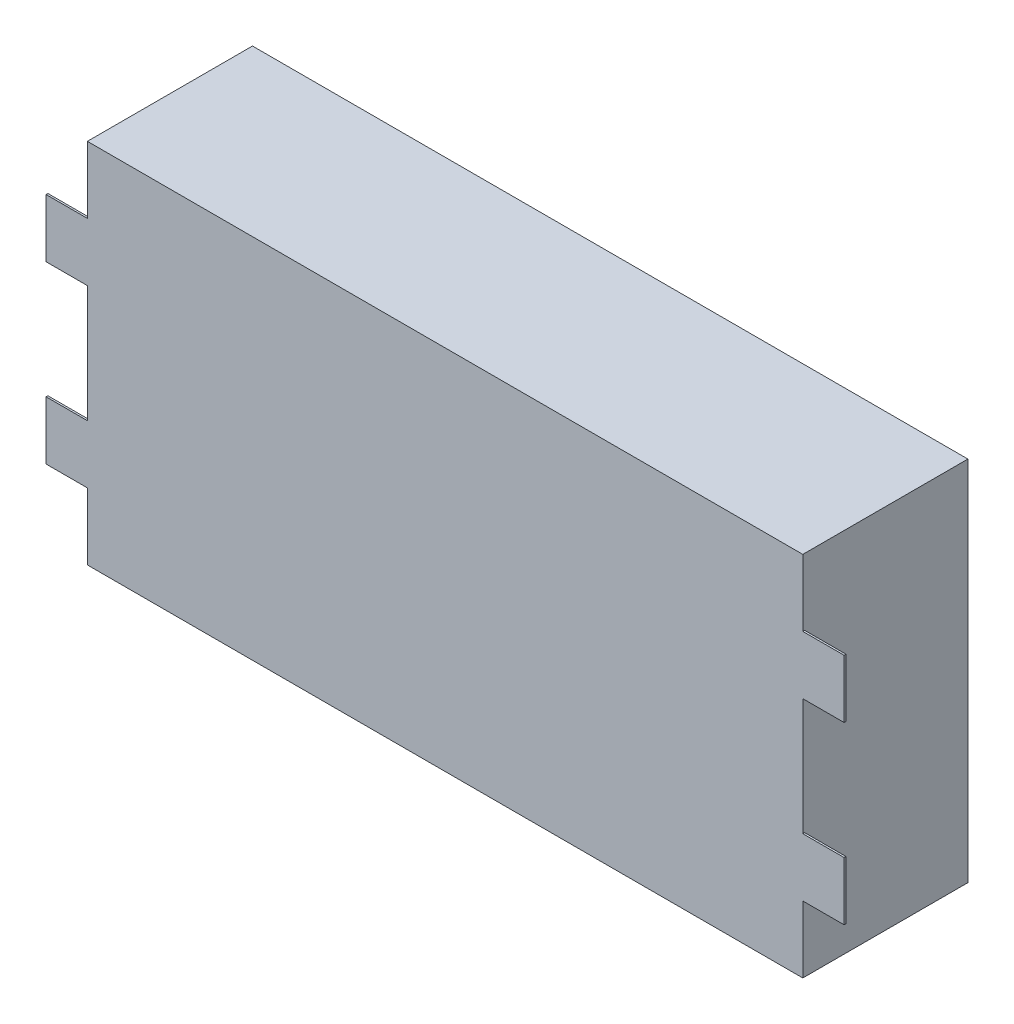
ISO-10303-21;
HEADER;
FILE_DESCRIPTION(('STEP AP214'),'2;1');
FILE_NAME('part.step','',(''),(''),'','','');
FILE_SCHEMA(('AUTOMOTIVE_DESIGN { 1 0 10303 214 1 1 1 1 }'));
ENDSEC;
DATA;
#1=APPLICATION_CONTEXT('core data for automotive mechanical design processes');
#2=APPLICATION_PROTOCOL_DEFINITION('international standard','automotive_design',2000,#1);
#3=PRODUCT_CONTEXT('',#1,'mechanical');
#4=PRODUCT('Part','Part','',(#3));
#5=PRODUCT_RELATED_PRODUCT_CATEGORY('part','',(#4));
#6=PRODUCT_DEFINITION_FORMATION('','',#4);
#7=PRODUCT_DEFINITION_CONTEXT('part definition',#1,'design');
#8=PRODUCT_DEFINITION('design','',#6,#7);
#9=PRODUCT_DEFINITION_SHAPE('','',#8);
#10=(LENGTH_UNIT() NAMED_UNIT(*) SI_UNIT(.MILLI.,.METRE.));
#11=(NAMED_UNIT(*) PLANE_ANGLE_UNIT() SI_UNIT($,.RADIAN.));
#12=(NAMED_UNIT(*) SI_UNIT($,.STERADIAN.) SOLID_ANGLE_UNIT());
#13=UNCERTAINTY_MEASURE_WITH_UNIT(LENGTH_MEASURE(1.E-05),#10,'distance_accuracy_value','');
#14=(GEOMETRIC_REPRESENTATION_CONTEXT(3) GLOBAL_UNCERTAINTY_ASSIGNED_CONTEXT((#13)) GLOBAL_UNIT_ASSIGNED_CONTEXT((#10,
#11,#12)) REPRESENTATION_CONTEXT('',''));
#15=CARTESIAN_POINT('',(0.,0.,0.));
#16=DIRECTION('',(0.,0.,1.));
#17=DIRECTION('',(1.,0.,0.));
#18=AXIS2_PLACEMENT_3D('',#15,#16,#17);
#19=CARTESIAN_POINT('',(39.,20.,18.));
#20=DIRECTION('',(-1.,0.,0.));
#21=DIRECTION('',(0.,-1.,0.));
#22=AXIS2_PLACEMENT_3D('',#19,#20,#21);
#23=PLANE('',#22);
#24=DIRECTION('',(0.,1.,0.));
#25=VECTOR('',#24,1.);
#26=CARTESIAN_POINT('',(39.,0.,17.8));
#27=LINE('',#26,#25);
#28=CARTESIAN_POINT('',(39.,-12.725,17.8));
#29=VERTEX_POINT('',#28);
#30=CARTESIAN_POINT('',(39.,-6.375,17.8));
#31=VERTEX_POINT('',#30);
#32=EDGE_CURVE('E183',#29,#31,#27,.T.);
#33=ORIENTED_EDGE('',*,*,#32,.F.);
#34=DIRECTION('',(0.,0.,1.));
#35=VECTOR('',#34,1.);
#36=CARTESIAN_POINT('',(39.,-12.725,17.8));
#37=LINE('',#36,#35);
#38=CARTESIAN_POINT('',(39.,-12.725,18.));
#39=VERTEX_POINT('',#38);
#40=EDGE_CURVE('E196',#29,#39,#37,.T.);
#41=ORIENTED_EDGE('',*,*,#40,.T.);
#42=DIRECTION('',(0.,1.,0.));
#43=VECTOR('',#42,1.);
#44=CARTESIAN_POINT('',(39.,20.,18.));
#45=LINE('',#44,#43);
#46=CARTESIAN_POINT('',(39.,-20.,18.));
#47=VERTEX_POINT('',#46);
#48=EDGE_CURVE('E296',#47,#39,#45,.T.);
#49=ORIENTED_EDGE('',*,*,#48,.F.);
#50=DIRECTION('',(0.,0.,-1.));
#51=VECTOR('',#50,1.);
#52=CARTESIAN_POINT('',(39.,-20.,18.));
#53=LINE('',#52,#51);
#54=CARTESIAN_POINT('',(39.,-20.,0.));
#55=VERTEX_POINT('',#54);
#56=EDGE_CURVE('E309',#47,#55,#53,.T.);
#57=ORIENTED_EDGE('',*,*,#56,.T.);
#58=DIRECTION('',(0.,1.,0.));
#59=VECTOR('',#58,1.);
#60=CARTESIAN_POINT('',(39.,20.,0.));
#61=LINE('',#60,#59);
#62=CARTESIAN_POINT('',(39.,20.,0.));
#63=VERTEX_POINT('',#62);
#64=EDGE_CURVE('E290',#55,#63,#61,.T.);
#65=ORIENTED_EDGE('',*,*,#64,.T.);
#66=DIRECTION('',(0.,0.,-1.));
#67=VECTOR('',#66,1.);
#68=CARTESIAN_POINT('',(39.,20.,18.));
#69=LINE('',#68,#67);
#70=CARTESIAN_POINT('',(39.,20.,18.));
#71=VERTEX_POINT('',#70);
#72=EDGE_CURVE('E11',#71,#63,#69,.T.);
#73=ORIENTED_EDGE('',*,*,#72,.F.);
#74=CARTESIAN_POINT('',(39.,12.725,18.));
#75=VERTEX_POINT('',#74);
#76=EDGE_CURVE('E300',#75,#71,#45,.T.);
#77=ORIENTED_EDGE('',*,*,#76,.F.);
#78=DIRECTION('',(0.,0.,1.));
#79=VECTOR('',#78,1.);
#80=CARTESIAN_POINT('',(39.,12.725,17.8));
#81=LINE('',#80,#79);
#82=CARTESIAN_POINT('',(39.,12.725,17.8));
#83=VERTEX_POINT('',#82);
#84=EDGE_CURVE('E221',#83,#75,#81,.T.);
#85=ORIENTED_EDGE('',*,*,#84,.F.);
#86=DIRECTION('',(0.,1.,0.));
#87=VECTOR('',#86,1.);
#88=CARTESIAN_POINT('',(39.,0.,17.8));
#89=LINE('',#88,#87);
#90=CARTESIAN_POINT('',(39.,6.375,17.8));
#91=VERTEX_POINT('',#90);
#92=EDGE_CURVE('E213',#91,#83,#89,.T.);
#93=ORIENTED_EDGE('',*,*,#92,.F.);
#94=DIRECTION('',(0.,0.,1.));
#95=VECTOR('',#94,1.);
#96=CARTESIAN_POINT('',(39.,6.375,17.8));
#97=LINE('',#96,#95);
#98=CARTESIAN_POINT('',(39.,6.375,18.));
#99=VERTEX_POINT('',#98);
#100=EDGE_CURVE('E234',#91,#99,#97,.T.);
#101=ORIENTED_EDGE('',*,*,#100,.T.);
#102=CARTESIAN_POINT('',(39.,-6.375,18.));
#103=VERTEX_POINT('',#102);
#104=EDGE_CURVE('E56',#103,#99,#45,.T.);
#105=ORIENTED_EDGE('',*,*,#104,.F.);
#106=DIRECTION('',(0.,0.,1.));
#107=VECTOR('',#106,1.);
#108=CARTESIAN_POINT('',(39.,-6.375,17.8));
#109=LINE('',#108,#107);
#110=EDGE_CURVE('E207',#31,#103,#109,.T.);
#111=ORIENTED_EDGE('',*,*,#110,.F.);
#112=EDGE_LOOP('',(#33,#41,#49,#57,#65,#73,#77,#85,#93,#101,#105,#111));
#113=FACE_BOUND('',#112,.T.);
#114=ADVANCED_FACE('F37',(#113),#23,.F.);
#115=CARTESIAN_POINT('',(-39.,20.,18.));
#116=DIRECTION('',(1.,0.,0.));
#117=DIRECTION('',(0.,0.,-1.));
#118=AXIS2_PLACEMENT_3D('',#115,#116,#117);
#119=PLANE('',#118);
#120=DIRECTION('',(0.,0.,1.));
#121=VECTOR('',#120,1.);
#122=CARTESIAN_POINT('',(-39.,-12.725,17.8));
#123=LINE('',#122,#121);
#124=CARTESIAN_POINT('',(-39.,-12.725,17.8));
#125=VERTEX_POINT('',#124);
#126=CARTESIAN_POINT('',(-39.,-12.725,18.));
#127=VERTEX_POINT('',#126);
#128=EDGE_CURVE('E249',#125,#127,#123,.T.);
#129=ORIENTED_EDGE('',*,*,#128,.F.);
#130=DIRECTION('',(0.,-1.,0.));
#131=VECTOR('',#130,1.);
#132=CARTESIAN_POINT('',(-39.,0.,17.8));
#133=LINE('',#132,#131);
#134=CARTESIAN_POINT('',(-39.,-6.375,17.8));
#135=VERTEX_POINT('',#134);
#136=EDGE_CURVE('E241',#135,#125,#133,.T.);
#137=ORIENTED_EDGE('',*,*,#136,.F.);
#138=DIRECTION('',(0.,0.,1.));
#139=VECTOR('',#138,1.);
#140=CARTESIAN_POINT('',(-39.,-6.375,17.8));
#141=LINE('',#140,#139);
#142=CARTESIAN_POINT('',(-39.,-6.375,18.));
#143=VERTEX_POINT('',#142);
#144=EDGE_CURVE('E263',#135,#143,#141,.T.);
#145=ORIENTED_EDGE('',*,*,#144,.T.);
#146=DIRECTION('',(0.,-1.,0.));
#147=VECTOR('',#146,1.);
#148=CARTESIAN_POINT('',(-39.,20.,18.));
#149=LINE('',#148,#147);
#150=CARTESIAN_POINT('',(-39.,6.375,18.));
#151=VERTEX_POINT('',#150);
#152=EDGE_CURVE('E307',#151,#143,#149,.T.);
#153=ORIENTED_EDGE('',*,*,#152,.F.);
#154=DIRECTION('',(0.,0.,1.));
#155=VECTOR('',#154,1.);
#156=CARTESIAN_POINT('',(-39.,6.375,17.8));
#157=LINE('',#156,#155);
#158=CARTESIAN_POINT('',(-39.,6.375,17.8));
#159=VERTEX_POINT('',#158);
#160=EDGE_CURVE('E291',#159,#151,#157,.T.);
#161=ORIENTED_EDGE('',*,*,#160,.F.);
#162=DIRECTION('',(0.,-1.,0.));
#163=VECTOR('',#162,1.);
#164=CARTESIAN_POINT('',(-39.,0.,17.8));
#165=LINE('',#164,#163);
#166=CARTESIAN_POINT('',(-39.,12.725,17.8));
#167=VERTEX_POINT('',#166);
#168=EDGE_CURVE('E277',#167,#159,#165,.T.);
#169=ORIENTED_EDGE('',*,*,#168,.F.);
#170=DIRECTION('',(0.,0.,1.));
#171=VECTOR('',#170,1.);
#172=CARTESIAN_POINT('',(-39.,12.725,17.8));
#173=LINE('',#172,#171);
#174=CARTESIAN_POINT('',(-39.,12.725,18.));
#175=VERTEX_POINT('',#174);
#176=EDGE_CURVE('E287',#167,#175,#173,.T.);
#177=ORIENTED_EDGE('',*,*,#176,.T.);
#178=CARTESIAN_POINT('',(-39.,20.,18.));
#179=VERTEX_POINT('',#178);
#180=EDGE_CURVE('E303',#179,#175,#149,.T.);
#181=ORIENTED_EDGE('',*,*,#180,.F.);
#182=DIRECTION('',(0.,0.,-1.));
#183=VECTOR('',#182,1.);
#184=CARTESIAN_POINT('',(-39.,20.,18.));
#185=LINE('',#184,#183);
#186=CARTESIAN_POINT('',(-39.,20.,0.));
#187=VERTEX_POINT('',#186);
#188=EDGE_CURVE('E44',#179,#187,#185,.T.);
#189=ORIENTED_EDGE('',*,*,#188,.T.);
#190=DIRECTION('',(0.,-1.,0.));
#191=VECTOR('',#190,1.);
#192=CARTESIAN_POINT('',(-39.,20.,0.));
#193=LINE('',#192,#191);
#194=CARTESIAN_POINT('',(-39.,-20.,0.));
#195=VERTEX_POINT('',#194);
#196=EDGE_CURVE('E314',#187,#195,#193,.T.);
#197=ORIENTED_EDGE('',*,*,#196,.T.);
#198=DIRECTION('',(0.,0.,-1.));
#199=VECTOR('',#198,1.);
#200=CARTESIAN_POINT('',(-39.,-20.,18.));
#201=LINE('',#200,#199);
#202=CARTESIAN_POINT('',(-39.,-20.,18.));
#203=VERTEX_POINT('',#202);
#204=EDGE_CURVE('E320',#203,#195,#201,.T.);
#205=ORIENTED_EDGE('',*,*,#204,.F.);
#206=EDGE_CURVE('E302',#127,#203,#149,.T.);
#207=ORIENTED_EDGE('',*,*,#206,.F.);
#208=EDGE_LOOP('',(#129,#137,#145,#153,#161,#169,#177,#181,#189,#197,#205,#207));
#209=FACE_BOUND('',#208,.T.);
#210=ADVANCED_FACE('F328',(#209),#119,.F.);
#211=CARTESIAN_POINT('',(-39.,20.,18.));
#212=DIRECTION('',(0.,-1.,0.));
#213=DIRECTION('',(1.,0.,0.));
#214=AXIS2_PLACEMENT_3D('',#211,#212,#213);
#215=PLANE('',#214);
#216=DIRECTION('',(-1.,0.,0.));
#217=VECTOR('',#216,1.);
#218=CARTESIAN_POINT('',(-39.,20.,0.));
#219=LINE('',#218,#217);
#220=EDGE_CURVE('E312',#63,#187,#219,.T.);
#221=ORIENTED_EDGE('',*,*,#220,.T.);
#222=ORIENTED_EDGE('',*,*,#188,.F.);
#223=DIRECTION('',(-1.,0.,0.));
#224=VECTOR('',#223,1.);
#225=CARTESIAN_POINT('',(-39.,20.,18.));
#226=LINE('',#225,#224);
#227=EDGE_CURVE('E299',#71,#179,#226,.T.);
#228=ORIENTED_EDGE('',*,*,#227,.F.);
#229=ORIENTED_EDGE('',*,*,#72,.T.);
#230=EDGE_LOOP('',(#221,#222,#228,#229));
#231=FACE_BOUND('',#230,.T.);
#232=ADVANCED_FACE('F379',(#231),#215,.F.);
#233=CARTESIAN_POINT('',(-39.,-20.,18.));
#234=DIRECTION('',(0.,1.,0.));
#235=DIRECTION('',(0.,0.,1.));
#236=AXIS2_PLACEMENT_3D('',#233,#234,#235);
#237=PLANE('',#236);
#238=DIRECTION('',(1.,0.,0.));
#239=VECTOR('',#238,1.);
#240=CARTESIAN_POINT('',(-39.,-20.,0.));
#241=LINE('',#240,#239);
#242=EDGE_CURVE('E316',#195,#55,#241,.T.);
#243=ORIENTED_EDGE('',*,*,#242,.T.);
#244=ORIENTED_EDGE('',*,*,#56,.F.);
#245=DIRECTION('',(1.,0.,0.));
#246=VECTOR('',#245,1.);
#247=CARTESIAN_POINT('',(-39.,-20.,18.));
#248=LINE('',#247,#246);
#249=EDGE_CURVE('E306',#203,#47,#248,.T.);
#250=ORIENTED_EDGE('',*,*,#249,.F.);
#251=ORIENTED_EDGE('',*,*,#204,.T.);
#252=EDGE_LOOP('',(#243,#244,#250,#251));
#253=FACE_BOUND('',#252,.T.);
#254=ADVANCED_FACE('F338',(#253),#237,.F.);
#255=CARTESIAN_POINT('',(0.,0.,18.));
#256=DIRECTION('',(0.,0.,1.));
#257=DIRECTION('',(1.,0.,0.));
#258=AXIS2_PLACEMENT_3D('',#255,#256,#257);
#259=PLANE('',#258);
#260=ORIENTED_EDGE('',*,*,#48,.T.);
#261=DIRECTION('',(1.,0.,0.));
#262=VECTOR('',#261,1.);
#263=CARTESIAN_POINT('',(0.,-12.725,18.));
#264=LINE('',#263,#262);
#265=CARTESIAN_POINT('',(43.5,-12.725,18.));
#266=VERTEX_POINT('',#265);
#267=EDGE_CURVE('E202',#39,#266,#264,.T.);
#268=ORIENTED_EDGE('',*,*,#267,.T.);
#269=DIRECTION('',(0.,1.,0.));
#270=VECTOR('',#269,1.);
#271=CARTESIAN_POINT('',(43.5,0.,18.));
#272=LINE('',#271,#270);
#273=CARTESIAN_POINT('',(43.5,-6.375,18.));
#274=VERTEX_POINT('',#273);
#275=EDGE_CURVE('E178',#266,#274,#272,.T.);
#276=ORIENTED_EDGE('',*,*,#275,.T.);
#277=DIRECTION('',(1.,0.,0.));
#278=VECTOR('',#277,1.);
#279=CARTESIAN_POINT('',(0.,-6.37499999999997,18.));
#280=LINE('',#279,#278);
#281=EDGE_CURVE('E51',#103,#274,#280,.T.);
#282=ORIENTED_EDGE('',*,*,#281,.F.);
#283=ORIENTED_EDGE('',*,*,#104,.T.);
#284=DIRECTION('',(1.,0.,0.));
#285=VECTOR('',#284,1.);
#286=CARTESIAN_POINT('',(0.,6.37499999999999,18.));
#287=LINE('',#286,#285);
#288=CARTESIAN_POINT('',(43.5,6.375,18.));
#289=VERTEX_POINT('',#288);
#290=EDGE_CURVE('E224',#99,#289,#287,.T.);
#291=ORIENTED_EDGE('',*,*,#290,.T.);
#292=DIRECTION('',(0.,-1.,0.));
#293=VECTOR('',#292,1.);
#294=CARTESIAN_POINT('',(43.5,0.,18.));
#295=LINE('',#294,#293);
#296=CARTESIAN_POINT('',(43.5,12.725,18.));
#297=VERTEX_POINT('',#296);
#298=EDGE_CURVE('E214',#297,#289,#295,.T.);
#299=ORIENTED_EDGE('',*,*,#298,.F.);
#300=DIRECTION('',(1.,0.,0.));
#301=VECTOR('',#300,1.);
#302=CARTESIAN_POINT('',(0.,12.7250000000001,18.));
#303=LINE('',#302,#301);
#304=EDGE_CURVE('E206',#75,#297,#303,.T.);
#305=ORIENTED_EDGE('',*,*,#304,.F.);
#306=ORIENTED_EDGE('',*,*,#76,.T.);
#307=ORIENTED_EDGE('',*,*,#227,.T.);
#308=ORIENTED_EDGE('',*,*,#180,.T.);
#309=DIRECTION('',(-1.,0.,0.));
#310=VECTOR('',#309,1.);
#311=CARTESIAN_POINT('',(0.,12.7250000000001,18.));
#312=LINE('',#311,#310);
#313=CARTESIAN_POINT('',(-43.5,12.725,18.));
#314=VERTEX_POINT('',#313);
#315=EDGE_CURVE('E260',#175,#314,#312,.T.);
#316=ORIENTED_EDGE('',*,*,#315,.T.);
#317=DIRECTION('',(0.,-1.,0.));
#318=VECTOR('',#317,1.);
#319=CARTESIAN_POINT('',(-43.5,0.,18.));
#320=LINE('',#319,#318);
#321=CARTESIAN_POINT('',(-43.5,6.375,18.));
#322=VERTEX_POINT('',#321);
#323=EDGE_CURVE('E282',#314,#322,#320,.T.);
#324=ORIENTED_EDGE('',*,*,#323,.T.);
#325=DIRECTION('',(-1.,0.,0.));
#326=VECTOR('',#325,1.);
#327=CARTESIAN_POINT('',(0.,6.37499999999999,18.));
#328=LINE('',#327,#326);
#329=EDGE_CURVE('E272',#151,#322,#328,.T.);
#330=ORIENTED_EDGE('',*,*,#329,.F.);
#331=ORIENTED_EDGE('',*,*,#152,.T.);
#332=DIRECTION('',(-1.,0.,0.));
#333=VECTOR('',#332,1.);
#334=CARTESIAN_POINT('',(0.,-6.37499999999997,18.));
#335=LINE('',#334,#333);
#336=CARTESIAN_POINT('',(-43.5,-6.375,18.));
#337=VERTEX_POINT('',#336);
#338=EDGE_CURVE('E252',#143,#337,#335,.T.);
#339=ORIENTED_EDGE('',*,*,#338,.T.);
#340=DIRECTION('',(0.,1.,0.));
#341=VECTOR('',#340,1.);
#342=CARTESIAN_POINT('',(-43.5,0.,18.));
#343=LINE('',#342,#341);
#344=CARTESIAN_POINT('',(-43.5,-12.725,18.));
#345=VERTEX_POINT('',#344);
#346=EDGE_CURVE('E242',#345,#337,#343,.T.);
#347=ORIENTED_EDGE('',*,*,#346,.F.);
#348=DIRECTION('',(-1.,0.,0.));
#349=VECTOR('',#348,1.);
#350=CARTESIAN_POINT('',(0.,-12.725,18.));
#351=LINE('',#350,#349);
#352=EDGE_CURVE('E231',#127,#345,#351,.T.);
#353=ORIENTED_EDGE('',*,*,#352,.F.);
#354=ORIENTED_EDGE('',*,*,#206,.T.);
#355=ORIENTED_EDGE('',*,*,#249,.T.);
#356=EDGE_LOOP('',(#260,#268,#276,#282,#283,#291,#299,#305,#306,#307,#308,#316,#324,#330,#331,
#339,#347,#353,#354,#355));
#357=FACE_BOUND('',#356,.T.);
#358=ADVANCED_FACE('F343',(#357),#259,.T.);
#359=CARTESIAN_POINT('',(0.,0.,0.));
#360=DIRECTION('',(0.,0.,1.));
#361=DIRECTION('',(1.,0.,0.));
#362=AXIS2_PLACEMENT_3D('',#359,#360,#361);
#363=PLANE('',#362);
#364=ORIENTED_EDGE('',*,*,#64,.F.);
#365=ORIENTED_EDGE('',*,*,#242,.F.);
#366=ORIENTED_EDGE('',*,*,#196,.F.);
#367=ORIENTED_EDGE('',*,*,#220,.F.);
#368=EDGE_LOOP('',(#364,#365,#366,#367));
#369=FACE_BOUND('',#368,.T.);
#370=ADVANCED_FACE('F335',(#369),#363,.F.);
#371=CARTESIAN_POINT('',(0.,12.7250000000001,17.8));
#372=DIRECTION('',(0.,1.,0.));
#373=DIRECTION('',(-1.,0.,0.));
#374=AXIS2_PLACEMENT_3D('',#371,#372,#373);
#375=PLANE('',#374);
#376=ORIENTED_EDGE('',*,*,#315,.F.);
#377=ORIENTED_EDGE('',*,*,#176,.F.);
#378=DIRECTION('',(-1.,0.,0.));
#379=VECTOR('',#378,1.);
#380=CARTESIAN_POINT('',(0.,12.7250000000001,17.8));
#381=LINE('',#380,#379);
#382=CARTESIAN_POINT('',(-43.5,12.725,17.8));
#383=VERTEX_POINT('',#382);
#384=EDGE_CURVE('E268',#167,#383,#381,.T.);
#385=ORIENTED_EDGE('',*,*,#384,.T.);
#386=DIRECTION('',(0.,0.,1.));
#387=VECTOR('',#386,1.);
#388=CARTESIAN_POINT('',(-43.5,12.725,17.8));
#389=LINE('',#388,#387);
#390=EDGE_CURVE('E279',#383,#314,#389,.T.);
#391=ORIENTED_EDGE('',*,*,#390,.T.);
#392=EDGE_LOOP('',(#376,#377,#385,#391));
#393=FACE_BOUND('',#392,.T.);
#394=ADVANCED_FACE('F389',(#393),#375,.T.);
#395=CARTESIAN_POINT('',(0.,6.37499999999999,17.8));
#396=DIRECTION('',(0.,1.,0.));
#397=DIRECTION('',(-1.,0.,0.));
#398=AXIS2_PLACEMENT_3D('',#395,#396,#397);
#399=PLANE('',#398);
#400=ORIENTED_EDGE('',*,*,#329,.T.);
#401=DIRECTION('',(0.,0.,1.));
#402=VECTOR('',#401,1.);
#403=CARTESIAN_POINT('',(-43.5,6.375,17.8));
#404=LINE('',#403,#402);
#405=CARTESIAN_POINT('',(-43.5,6.375,17.8));
#406=VERTEX_POINT('',#405);
#407=EDGE_CURVE('E293',#406,#322,#404,.T.);
#408=ORIENTED_EDGE('',*,*,#407,.F.);
#409=DIRECTION('',(-1.,0.,0.));
#410=VECTOR('',#409,1.);
#411=CARTESIAN_POINT('',(0.,6.37499999999999,17.8));
#412=LINE('',#411,#410);
#413=EDGE_CURVE('E275',#159,#406,#412,.T.);
#414=ORIENTED_EDGE('',*,*,#413,.F.);
#415=ORIENTED_EDGE('',*,*,#160,.T.);
#416=EDGE_LOOP('',(#400,#408,#414,#415));
#417=FACE_BOUND('',#416,.T.);
#418=ADVANCED_FACE('F394',(#417),#399,.F.);
#419=CARTESIAN_POINT('',(-43.5,0.,17.8));
#420=DIRECTION('',(-1.,0.,0.));
#421=DIRECTION('',(0.,0.,1.));
#422=AXIS2_PLACEMENT_3D('',#419,#420,#421);
#423=PLANE('',#422);
#424=ORIENTED_EDGE('',*,*,#323,.F.);
#425=ORIENTED_EDGE('',*,*,#390,.F.);
#426=DIRECTION('',(0.,-1.,0.));
#427=VECTOR('',#426,1.);
#428=CARTESIAN_POINT('',(-43.5,0.,17.8));
#429=LINE('',#428,#427);
#430=EDGE_CURVE('E271',#383,#406,#429,.T.);
#431=ORIENTED_EDGE('',*,*,#430,.T.);
#432=ORIENTED_EDGE('',*,*,#407,.T.);
#433=EDGE_LOOP('',(#424,#425,#431,#432));
#434=FACE_BOUND('',#433,.T.);
#435=ADVANCED_FACE('F371',(#434),#423,.T.);
#436=CARTESIAN_POINT('',(0.,0.,17.8));
#437=DIRECTION('',(0.,0.,1.));
#438=DIRECTION('',(1.,0.,0.));
#439=AXIS2_PLACEMENT_3D('',#436,#437,#438);
#440=PLANE('',#439);
#441=ORIENTED_EDGE('',*,*,#384,.F.);
#442=ORIENTED_EDGE('',*,*,#168,.T.);
#443=ORIENTED_EDGE('',*,*,#413,.T.);
#444=ORIENTED_EDGE('',*,*,#430,.F.);
#445=EDGE_LOOP('',(#441,#442,#443,#444));
#446=FACE_BOUND('',#445,.T.);
#447=ADVANCED_FACE('F364',(#446),#440,.F.);
#448=CARTESIAN_POINT('',(0.,-12.725,17.8));
#449=DIRECTION('',(0.,1.,0.));
#450=DIRECTION('',(-1.,0.,0.));
#451=AXIS2_PLACEMENT_3D('',#448,#449,#450);
#452=PLANE('',#451);
#453=ORIENTED_EDGE('',*,*,#352,.T.);
#454=DIRECTION('',(0.,0.,1.));
#455=VECTOR('',#454,1.);
#456=CARTESIAN_POINT('',(-43.5,-12.725,17.8));
#457=LINE('',#456,#455);
#458=CARTESIAN_POINT('',(-43.5,-12.725,17.8));
#459=VERTEX_POINT('',#458);
#460=EDGE_CURVE('E257',#459,#345,#457,.T.);
#461=ORIENTED_EDGE('',*,*,#460,.F.);
#462=DIRECTION('',(-1.,0.,0.));
#463=VECTOR('',#462,1.);
#464=CARTESIAN_POINT('',(0.,-12.725,17.8));
#465=LINE('',#464,#463);
#466=EDGE_CURVE('E238',#125,#459,#465,.T.);
#467=ORIENTED_EDGE('',*,*,#466,.F.);
#468=ORIENTED_EDGE('',*,*,#128,.T.);
#469=EDGE_LOOP('',(#453,#461,#467,#468));
#470=FACE_BOUND('',#469,.T.);
#471=ADVANCED_FACE('F362',(#470),#452,.F.);
#472=CARTESIAN_POINT('',(-43.5,0.,17.8));
#473=DIRECTION('',(1.,0.,0.));
#474=DIRECTION('',(0.,0.,-1.));
#475=AXIS2_PLACEMENT_3D('',#472,#473,#474);
#476=PLANE('',#475);
#477=ORIENTED_EDGE('',*,*,#346,.T.);
#478=DIRECTION('',(0.,0.,1.));
#479=VECTOR('',#478,1.);
#480=CARTESIAN_POINT('',(-43.5,-6.375,17.8));
#481=LINE('',#480,#479);
#482=CARTESIAN_POINT('',(-43.5,-6.375,17.8));
#483=VERTEX_POINT('',#482);
#484=EDGE_CURVE('E261',#483,#337,#481,.T.);
#485=ORIENTED_EDGE('',*,*,#484,.F.);
#486=DIRECTION('',(0.,1.,0.));
#487=VECTOR('',#486,1.);
#488=CARTESIAN_POINT('',(-43.5,0.,17.8));
#489=LINE('',#488,#487);
#490=EDGE_CURVE('E247',#459,#483,#489,.T.);
#491=ORIENTED_EDGE('',*,*,#490,.F.);
#492=ORIENTED_EDGE('',*,*,#460,.T.);
#493=EDGE_LOOP('',(#477,#485,#491,#492));
#494=FACE_BOUND('',#493,.T.);
#495=ADVANCED_FACE('F360',(#494),#476,.F.);
#496=CARTESIAN_POINT('',(0.,-6.37499999999997,17.8));
#497=DIRECTION('',(0.,1.,0.));
#498=DIRECTION('',(-1.,0.,0.));
#499=AXIS2_PLACEMENT_3D('',#496,#497,#498);
#500=PLANE('',#499);
#501=ORIENTED_EDGE('',*,*,#338,.F.);
#502=ORIENTED_EDGE('',*,*,#144,.F.);
#503=DIRECTION('',(-1.,0.,0.));
#504=VECTOR('',#503,1.);
#505=CARTESIAN_POINT('',(0.,-6.37499999999997,17.8));
#506=LINE('',#505,#504);
#507=EDGE_CURVE('E244',#135,#483,#506,.T.);
#508=ORIENTED_EDGE('',*,*,#507,.T.);
#509=ORIENTED_EDGE('',*,*,#484,.T.);
#510=EDGE_LOOP('',(#501,#502,#508,#509));
#511=FACE_BOUND('',#510,.T.);
#512=ADVANCED_FACE('F353',(#511),#500,.T.);
#513=CARTESIAN_POINT('',(0.,0.,17.8));
#514=DIRECTION('',(0.,0.,1.));
#515=DIRECTION('',(1.,0.,0.));
#516=AXIS2_PLACEMENT_3D('',#513,#514,#515);
#517=PLANE('',#516);
#518=ORIENTED_EDGE('',*,*,#466,.T.);
#519=ORIENTED_EDGE('',*,*,#490,.T.);
#520=ORIENTED_EDGE('',*,*,#507,.F.);
#521=ORIENTED_EDGE('',*,*,#136,.T.);
#522=EDGE_LOOP('',(#518,#519,#520,#521));
#523=FACE_BOUND('',#522,.T.);
#524=ADVANCED_FACE('F355',(#523),#517,.F.);
#525=CARTESIAN_POINT('',(0.,12.7250000000001,17.8));
#526=DIRECTION('',(0.,-1.,0.));
#527=DIRECTION('',(1.,0.,0.));
#528=AXIS2_PLACEMENT_3D('',#525,#526,#527);
#529=PLANE('',#528);
#530=ORIENTED_EDGE('',*,*,#304,.T.);
#531=DIRECTION('',(0.,0.,1.));
#532=VECTOR('',#531,1.);
#533=CARTESIAN_POINT('',(43.5,12.725,17.8));
#534=LINE('',#533,#532);
#535=CARTESIAN_POINT('',(43.5,12.725,17.8));
#536=VERTEX_POINT('',#535);
#537=EDGE_CURVE('E228',#536,#297,#534,.T.);
#538=ORIENTED_EDGE('',*,*,#537,.F.);
#539=DIRECTION('',(1.,0.,0.));
#540=VECTOR('',#539,1.);
#541=CARTESIAN_POINT('',(0.,12.7250000000001,17.8));
#542=LINE('',#541,#540);
#543=EDGE_CURVE('E210',#83,#536,#542,.T.);
#544=ORIENTED_EDGE('',*,*,#543,.F.);
#545=ORIENTED_EDGE('',*,*,#84,.T.);
#546=EDGE_LOOP('',(#530,#538,#544,#545));
#547=FACE_BOUND('',#546,.T.);
#548=ADVANCED_FACE('F414',(#547),#529,.F.);
#549=CARTESIAN_POINT('',(43.5,0.,17.8));
#550=DIRECTION('',(-1.,0.,0.));
#551=DIRECTION('',(0.,0.,1.));
#552=AXIS2_PLACEMENT_3D('',#549,#550,#551);
#553=PLANE('',#552);
#554=ORIENTED_EDGE('',*,*,#298,.T.);
#555=DIRECTION('',(0.,0.,1.));
#556=VECTOR('',#555,1.);
#557=CARTESIAN_POINT('',(43.5,6.375,17.8));
#558=LINE('',#557,#556);
#559=CARTESIAN_POINT('',(43.5,6.375,17.8));
#560=VERTEX_POINT('',#559);
#561=EDGE_CURVE('E232',#560,#289,#558,.T.);
#562=ORIENTED_EDGE('',*,*,#561,.F.);
#563=DIRECTION('',(0.,-1.,0.));
#564=VECTOR('',#563,1.);
#565=CARTESIAN_POINT('',(43.5,0.,17.8));
#566=LINE('',#565,#564);
#567=EDGE_CURVE('E219',#536,#560,#566,.T.);
#568=ORIENTED_EDGE('',*,*,#567,.F.);
#569=ORIENTED_EDGE('',*,*,#537,.T.);
#570=EDGE_LOOP('',(#554,#562,#568,#569));
#571=FACE_BOUND('',#570,.T.);
#572=ADVANCED_FACE('F418',(#571),#553,.F.);
#573=CARTESIAN_POINT('',(0.,6.37499999999999,17.8));
#574=DIRECTION('',(0.,-1.,0.));
#575=DIRECTION('',(1.,0.,0.));
#576=AXIS2_PLACEMENT_3D('',#573,#574,#575);
#577=PLANE('',#576);
#578=ORIENTED_EDGE('',*,*,#290,.F.);
#579=ORIENTED_EDGE('',*,*,#100,.F.);
#580=DIRECTION('',(1.,0.,0.));
#581=VECTOR('',#580,1.);
#582=CARTESIAN_POINT('',(0.,6.37499999999999,17.8));
#583=LINE('',#582,#581);
#584=EDGE_CURVE('E216',#91,#560,#583,.T.);
#585=ORIENTED_EDGE('',*,*,#584,.T.);
#586=ORIENTED_EDGE('',*,*,#561,.T.);
#587=EDGE_LOOP('',(#578,#579,#585,#586));
#588=FACE_BOUND('',#587,.T.);
#589=ADVANCED_FACE('F423',(#588),#577,.T.);
#590=CARTESIAN_POINT('',(0.,0.,17.8));
#591=DIRECTION('',(0.,0.,1.));
#592=DIRECTION('',(1.,0.,0.));
#593=AXIS2_PLACEMENT_3D('',#590,#591,#592);
#594=PLANE('',#593);
#595=ORIENTED_EDGE('',*,*,#543,.T.);
#596=ORIENTED_EDGE('',*,*,#567,.T.);
#597=ORIENTED_EDGE('',*,*,#584,.F.);
#598=ORIENTED_EDGE('',*,*,#92,.T.);
#599=EDGE_LOOP('',(#595,#596,#597,#598));
#600=FACE_BOUND('',#599,.T.);
#601=ADVANCED_FACE('F421',(#600),#594,.F.);
#602=CARTESIAN_POINT('',(0.,-12.725,17.8));
#603=DIRECTION('',(0.,-1.,0.));
#604=DIRECTION('',(1.,0.,0.));
#605=AXIS2_PLACEMENT_3D('',#602,#603,#604);
#606=PLANE('',#605);
#607=ORIENTED_EDGE('',*,*,#267,.F.);
#608=ORIENTED_EDGE('',*,*,#40,.F.);
#609=DIRECTION('',(1.,0.,0.));
#610=VECTOR('',#609,1.);
#611=CARTESIAN_POINT('',(0.,-12.725,17.8));
#612=LINE('',#611,#610);
#613=CARTESIAN_POINT('',(43.5,-12.725,17.8));
#614=VERTEX_POINT('',#613);
#615=EDGE_CURVE('E188',#29,#614,#612,.T.);
#616=ORIENTED_EDGE('',*,*,#615,.T.);
#617=DIRECTION('',(0.,0.,1.));
#618=VECTOR('',#617,1.);
#619=CARTESIAN_POINT('',(43.5,-12.725,17.8));
#620=LINE('',#619,#618);
#621=EDGE_CURVE('E174',#614,#266,#620,.T.);
#622=ORIENTED_EDGE('',*,*,#621,.T.);
#623=EDGE_LOOP('',(#607,#608,#616,#622));
#624=FACE_BOUND('',#623,.T.);
#625=ADVANCED_FACE('F194',(#624),#606,.T.);
#626=CARTESIAN_POINT('',(0.,-6.37499999999997,17.8));
#627=DIRECTION('',(0.,-1.,0.));
#628=DIRECTION('',(1.,0.,0.));
#629=AXIS2_PLACEMENT_3D('',#626,#627,#628);
#630=PLANE('',#629);
#631=ORIENTED_EDGE('',*,*,#281,.T.);
#632=DIRECTION('',(0.,0.,1.));
#633=VECTOR('',#632,1.);
#634=CARTESIAN_POINT('',(43.5,-6.375,17.8));
#635=LINE('',#634,#633);
#636=CARTESIAN_POINT('',(43.5,-6.375,17.8));
#637=VERTEX_POINT('',#636);
#638=EDGE_CURVE('E182',#637,#274,#635,.T.);
#639=ORIENTED_EDGE('',*,*,#638,.F.);
#640=DIRECTION('',(1.,0.,0.));
#641=VECTOR('',#640,1.);
#642=CARTESIAN_POINT('',(0.,-6.37499999999997,17.8));
#643=LINE('',#642,#641);
#644=EDGE_CURVE('E191',#31,#637,#643,.T.);
#645=ORIENTED_EDGE('',*,*,#644,.F.);
#646=ORIENTED_EDGE('',*,*,#110,.T.);
#647=EDGE_LOOP('',(#631,#639,#645,#646));
#648=FACE_BOUND('',#647,.T.);
#649=ADVANCED_FACE('F426',(#648),#630,.F.);
#650=CARTESIAN_POINT('',(43.5,0.,17.8));
#651=DIRECTION('',(1.,0.,0.));
#652=DIRECTION('',(0.,0.,-1.));
#653=AXIS2_PLACEMENT_3D('',#650,#651,#652);
#654=PLANE('',#653);
#655=ORIENTED_EDGE('',*,*,#275,.F.);
#656=ORIENTED_EDGE('',*,*,#621,.F.);
#657=DIRECTION('',(0.,1.,0.));
#658=VECTOR('',#657,1.);
#659=CARTESIAN_POINT('',(43.5,0.,17.8));
#660=LINE('',#659,#658);
#661=EDGE_CURVE('E177',#614,#637,#660,.T.);
#662=ORIENTED_EDGE('',*,*,#661,.T.);
#663=ORIENTED_EDGE('',*,*,#638,.T.);
#664=EDGE_LOOP('',(#655,#656,#662,#663));
#665=FACE_BOUND('',#664,.T.);
#666=ADVANCED_FACE('F176',(#665),#654,.T.);
#667=CARTESIAN_POINT('',(0.,0.,17.8));
#668=DIRECTION('',(0.,0.,1.));
#669=DIRECTION('',(1.,0.,0.));
#670=AXIS2_PLACEMENT_3D('',#667,#668,#669);
#671=PLANE('',#670);
#672=ORIENTED_EDGE('',*,*,#615,.F.);
#673=ORIENTED_EDGE('',*,*,#32,.T.);
#674=ORIENTED_EDGE('',*,*,#644,.T.);
#675=ORIENTED_EDGE('',*,*,#661,.F.);
#676=EDGE_LOOP('',(#672,#673,#674,#675));
#677=FACE_BOUND('',#676,.T.);
#678=ADVANCED_FACE('F187',(#677),#671,.F.);
#679=CLOSED_SHELL('',(#114,#210,#232,#254,#358,#370,#394,#418,#435,#447,#471,#495,#512,#524,
#548,#572,#589,#601,#625,#649,#666,#678));
#680=MANIFOLD_SOLID_BREP('B2',#679);
#681=ADVANCED_BREP_SHAPE_REPRESENTATION('',(#18,#680),#14);
#682=SHAPE_DEFINITION_REPRESENTATION(#9,#681);
ENDSEC;
END-ISO-10303-21;
